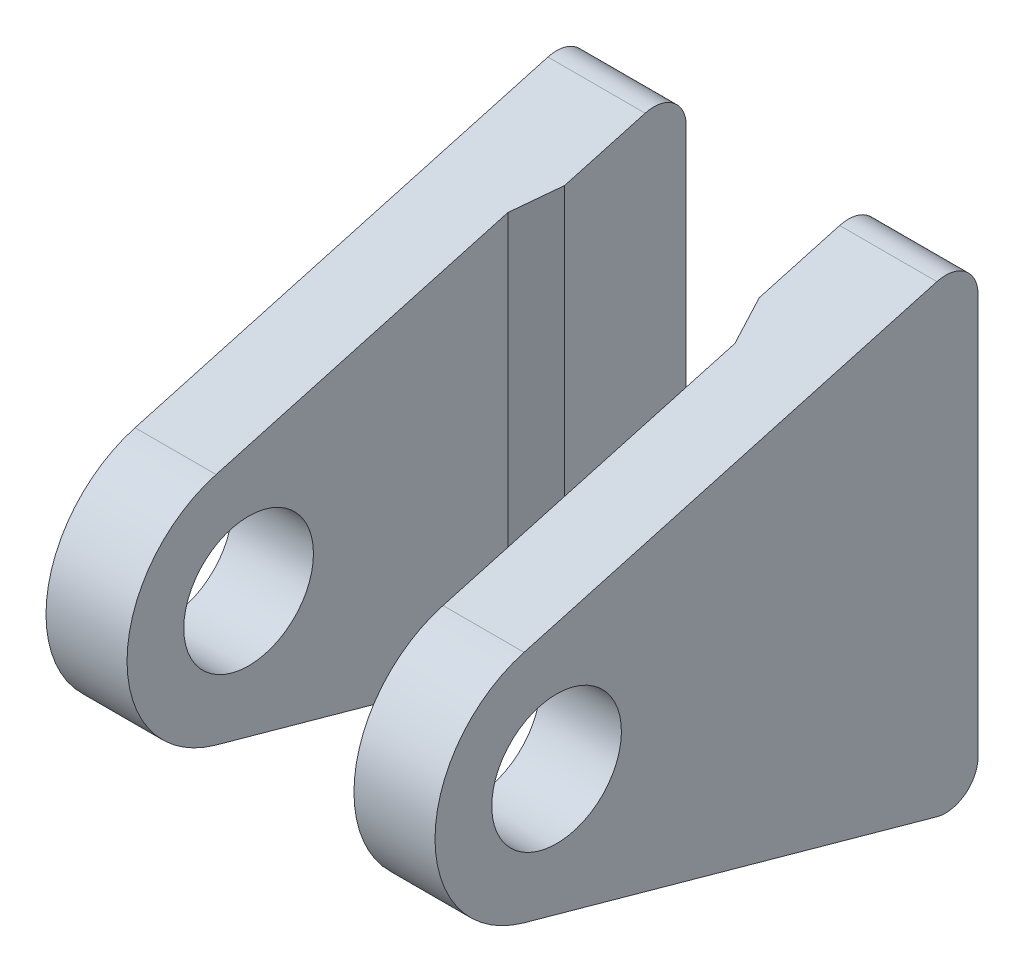
ISO-10303-21;
HEADER;
FILE_DESCRIPTION(('STEP AP214'),'2;1');
FILE_NAME('part.step','',(''),(''),'','','');
FILE_SCHEMA(('AUTOMOTIVE_DESIGN { 1 0 10303 214 1 1 1 1 }'));
ENDSEC;
DATA;
#1=APPLICATION_CONTEXT('core data for automotive mechanical design processes');
#2=APPLICATION_PROTOCOL_DEFINITION('international standard','automotive_design',2000,#1);
#3=PRODUCT_CONTEXT('',#1,'mechanical');
#4=PRODUCT('Part','Part','',(#3));
#5=PRODUCT_RELATED_PRODUCT_CATEGORY('part','',(#4));
#6=PRODUCT_DEFINITION_FORMATION('','',#4);
#7=PRODUCT_DEFINITION_CONTEXT('part definition',#1,'design');
#8=PRODUCT_DEFINITION('design','',#6,#7);
#9=PRODUCT_DEFINITION_SHAPE('','',#8);
#10=(LENGTH_UNIT() NAMED_UNIT(*) SI_UNIT(.MILLI.,.METRE.));
#11=(NAMED_UNIT(*) PLANE_ANGLE_UNIT() SI_UNIT($,.RADIAN.));
#12=(NAMED_UNIT(*) SI_UNIT($,.STERADIAN.) SOLID_ANGLE_UNIT());
#13=UNCERTAINTY_MEASURE_WITH_UNIT(LENGTH_MEASURE(1.E-05),#10,'distance_accuracy_value','');
#14=(GEOMETRIC_REPRESENTATION_CONTEXT(3) GLOBAL_UNCERTAINTY_ASSIGNED_CONTEXT((#13)) GLOBAL_UNIT_ASSIGNED_CONTEXT((#10,
#11,#12)) REPRESENTATION_CONTEXT('',''));
#15=CARTESIAN_POINT('',(0.,0.,0.));
#16=DIRECTION('',(0.,0.,1.));
#17=DIRECTION('',(1.,0.,0.));
#18=AXIS2_PLACEMENT_3D('',#15,#16,#17);
#19=CARTESIAN_POINT('',(-12.,15.,4.));
#20=DIRECTION('',(1.,0.,0.));
#21=DIRECTION('',(0.,1.,0.));
#22=AXIS2_PLACEMENT_3D('',#19,#20,#21);
#23=PLANE('',#22);
#24=CARTESIAN_POINT('',(-12.,0.,30.));
#25=DIRECTION('',(1.,0.,0.));
#26=DIRECTION('',(0.,1.,0.));
#27=AXIS2_PLACEMENT_3D('',#24,#25,#26);
#28=CIRCLE('',#27,4.);
#29=CARTESIAN_POINT('',(-12.,4.,30.));
#30=VERTEX_POINT('',#29);
#31=EDGE_CURVE('E173',#30,#30,#28,.T.);
#32=ORIENTED_EDGE('',*,*,#31,.T.);
#33=EDGE_LOOP('',(#32));
#34=FACE_BOUND('',#33,.T.);
#35=DIRECTION('',(0.,0.267445892208667,-0.963572879828355));
#36=VECTOR('',#35,1.);
#37=CARTESIAN_POINT('',(-12.,15.,4.));
#38=LINE('',#37,#36);
#39=CARTESIAN_POINT('',(-12.,7.22679659871266,32.005844191565));
#40=VERTEX_POINT('',#39);
#41=CARTESIAN_POINT('',(-12.,14.2964243710796,6.53489178441733));
#42=VERTEX_POINT('',#41);
#43=EDGE_CURVE('E155',#40,#42,#38,.T.);
#44=ORIENTED_EDGE('',*,*,#43,.T.);
#45=CARTESIAN_POINT('',(-12.,12.3692786114229,6.));
#46=DIRECTION('',(1.,0.,0.));
#47=DIRECTION('',(0.,1.,0.));
#48=AXIS2_PLACEMENT_3D('',#45,#46,#47);
#49=CIRCLE('',#48,2.);
#50=CARTESIAN_POINT('',(-12.,12.3692786114229,4.));
#51=VERTEX_POINT('',#50);
#52=EDGE_CURVE('E192',#42,#51,#49,.F.);
#53=ORIENTED_EDGE('',*,*,#52,.T.);
#54=DIRECTION('',(0.,1.,0.));
#55=VECTOR('',#54,1.);
#56=CARTESIAN_POINT('',(-12.,15.,4.));
#57=LINE('',#56,#55);
#58=CARTESIAN_POINT('',(-12.,-12.3692786114228,4.));
#59=VERTEX_POINT('',#58);
#60=EDGE_CURVE('E204',#59,#51,#57,.T.);
#61=ORIENTED_EDGE('',*,*,#60,.F.);
#62=CARTESIAN_POINT('',(-12.,-12.3692786114228,6.));
#63=DIRECTION('',(1.,0.,0.));
#64=DIRECTION('',(0.,1.,0.));
#65=AXIS2_PLACEMENT_3D('',#62,#63,#64);
#66=CIRCLE('',#65,2.);
#67=CARTESIAN_POINT('',(-12.,-14.2964243710796,6.53489178441733));
#68=VERTEX_POINT('',#67);
#69=EDGE_CURVE('E190',#59,#68,#66,.F.);
#70=ORIENTED_EDGE('',*,*,#69,.T.);
#71=DIRECTION('',(0.,0.267445892208666,0.963572879828355));
#72=VECTOR('',#71,1.);
#73=CARTESIAN_POINT('',(-12.,-15.,4.));
#74=LINE('',#73,#72);
#75=CARTESIAN_POINT('',(-12.,-7.22679659871267,32.005844191565));
#76=VERTEX_POINT('',#75);
#77=EDGE_CURVE('E172',#68,#76,#74,.T.);
#78=ORIENTED_EDGE('',*,*,#77,.T.);
#79=CARTESIAN_POINT('',(-12.,0.,30.));
#80=DIRECTION('',(-1.,0.,0.));
#81=DIRECTION('',(0.,-1.,0.));
#82=AXIS2_PLACEMENT_3D('',#79,#80,#81);
#83=CIRCLE('',#82,7.5);
#84=EDGE_CURVE('E169',#76,#40,#83,.T.);
#85=ORIENTED_EDGE('',*,*,#84,.T.);
#86=EDGE_LOOP('',(#44,#53,#61,#70,#78,#85));
#87=FACE_BOUND('',#86,.T.);
#88=ADVANCED_FACE('F54',(#34,#87),#23,.F.);
#89=CARTESIAN_POINT('',(-6.,15.,37.5));
#90=DIRECTION('',(-1.,0.,0.));
#91=DIRECTION('',(0.,0.,1.));
#92=AXIS2_PLACEMENT_3D('',#89,#90,#91);
#93=PLANE('',#92);
#94=DIRECTION('',(0.,-1.,0.));
#95=VECTOR('',#94,1.);
#96=CARTESIAN_POINT('',(-6.,15.,4.));
#97=LINE('',#96,#95);
#98=CARTESIAN_POINT('',(-6.,12.3692786114229,4.));
#99=VERTEX_POINT('',#98);
#100=CARTESIAN_POINT('',(-6.,-12.3692786114228,4.));
#101=VERTEX_POINT('',#100);
#102=EDGE_CURVE('E186',#99,#101,#97,.T.);
#103=ORIENTED_EDGE('',*,*,#102,.F.);
#104=CARTESIAN_POINT('',(-6.,12.3692786114229,6.));
#105=DIRECTION('',(-1.,0.,0.));
#106=DIRECTION('',(0.,0.,1.));
#107=AXIS2_PLACEMENT_3D('',#104,#105,#106);
#108=CIRCLE('',#107,2.);
#109=CARTESIAN_POINT('',(-6.,14.2964243710796,6.53489178441733));
#110=VERTEX_POINT('',#109);
#111=EDGE_CURVE('E62',#99,#110,#108,.F.);
#112=ORIENTED_EDGE('',*,*,#111,.T.);
#113=DIRECTION('',(0.,-0.267445892208667,0.963572879828355));
#114=VECTOR('',#113,1.);
#115=CARTESIAN_POINT('',(-6.,15.,4.));
#116=LINE('',#115,#114);
#117=CARTESIAN_POINT('',(-6.,12.9183264353369,11.4999999999999));
#118=VERTEX_POINT('',#117);
#119=EDGE_CURVE('E123',#110,#118,#116,.T.);
#120=ORIENTED_EDGE('',*,*,#119,.T.);
#121=DIRECTION('',(0.,1.,0.));
#122=VECTOR('',#121,1.);
#123=CARTESIAN_POINT('',(-6.,0.,11.5));
#124=LINE('',#123,#122);
#125=CARTESIAN_POINT('',(-6.,-12.9183264353369,11.5));
#126=VERTEX_POINT('',#125);
#127=EDGE_CURVE('E126',#126,#118,#124,.T.);
#128=ORIENTED_EDGE('',*,*,#127,.F.);
#129=DIRECTION('',(0.,-0.267445892208666,-0.963572879828355));
#130=VECTOR('',#129,1.);
#131=CARTESIAN_POINT('',(-6.,-15.,4.));
#132=LINE('',#131,#130);
#133=CARTESIAN_POINT('',(-6.,-14.2964243710796,6.53489178441733));
#134=VERTEX_POINT('',#133);
#135=EDGE_CURVE('E133',#126,#134,#132,.T.);
#136=ORIENTED_EDGE('',*,*,#135,.T.);
#137=CARTESIAN_POINT('',(-6.,-12.3692786114228,6.));
#138=DIRECTION('',(-1.,0.,0.));
#139=DIRECTION('',(0.,0.,1.));
#140=AXIS2_PLACEMENT_3D('',#137,#138,#139);
#141=CIRCLE('',#140,2.);
#142=EDGE_CURVE('E69',#134,#101,#141,.F.);
#143=ORIENTED_EDGE('',*,*,#142,.T.);
#144=EDGE_LOOP('',(#103,#112,#120,#128,#136,#143));
#145=FACE_BOUND('',#144,.T.);
#146=ADVANCED_FACE('F125',(#145),#93,.F.);
#147=CARTESIAN_POINT('',(-7.,15.,4.));
#148=DIRECTION('',(0.,0.963572879828355,0.267445892208667));
#149=DIRECTION('',(0.,-0.267445892208667,0.963572879828355));
#150=AXIS2_PLACEMENT_3D('',#147,#148,#149);
#151=PLANE('',#150);
#152=ORIENTED_EDGE('',*,*,#119,.F.);
#153=DIRECTION('',(-1.,0.,0.));
#154=VECTOR('',#153,1.);
#155=CARTESIAN_POINT('',(-7.,14.2964243710796,6.53489178441733));
#156=LINE('',#155,#154);
#157=EDGE_CURVE('E188',#110,#42,#156,.T.);
#158=ORIENTED_EDGE('',*,*,#157,.T.);
#159=ORIENTED_EDGE('',*,*,#43,.F.);
#160=DIRECTION('',(-1.,0.,0.));
#161=VECTOR('',#160,1.);
#162=CARTESIAN_POINT('',(-7.,7.22679659871266,32.005844191565));
#163=LINE('',#162,#161);
#164=CARTESIAN_POINT('',(-7.,7.22679659871266,32.005844191565));
#165=VERTEX_POINT('',#164);
#166=EDGE_CURVE('E153',#165,#40,#163,.T.);
#167=ORIENTED_EDGE('',*,*,#166,.F.);
#168=DIRECTION('',(0.,0.267445892208667,-0.963572879828355));
#169=VECTOR('',#168,1.);
#170=CARTESIAN_POINT('',(-7.,15.,4.));
#171=LINE('',#170,#169);
#172=CARTESIAN_POINT('',(-7.,12.2244352471159,13.9999999999999));
#173=VERTEX_POINT('',#172);
#174=EDGE_CURVE('E149',#165,#173,#171,.T.);
#175=ORIENTED_EDGE('',*,*,#174,.T.);
#176=DIRECTION('',(0.359640457707022,0.249551344530682,-0.899101144267547));
#177=VECTOR('',#176,1.);
#178=CARTESIAN_POINT('',(-4.34623139652626,14.0658618966439,7.36557849131562));
#179=LINE('',#178,#177);
#180=EDGE_CURVE('E141',#173,#118,#179,.T.);
#181=ORIENTED_EDGE('',*,*,#180,.T.);
#182=EDGE_LOOP('',(#152,#158,#159,#167,#175,#181));
#183=FACE_BOUND('',#182,.T.);
#184=ADVANCED_FACE('F147',(#183),#151,.T.);
#185=CARTESIAN_POINT('',(-7.,0.,30.));
#186=DIRECTION('',(-1.,0.,0.));
#187=DIRECTION('',(0.,-1.,0.));
#188=AXIS2_PLACEMENT_3D('',#185,#186,#187);
#189=CYLINDRICAL_SURFACE('',#188,7.5);
#190=ORIENTED_EDGE('',*,*,#84,.F.);
#191=DIRECTION('',(-1.,0.,0.));
#192=VECTOR('',#191,1.);
#193=CARTESIAN_POINT('',(-7.,-7.22679659871267,32.005844191565));
#194=LINE('',#193,#192);
#195=CARTESIAN_POINT('',(-7.,-7.22679659871267,32.005844191565));
#196=VERTEX_POINT('',#195);
#197=EDGE_CURVE('E163',#196,#76,#194,.T.);
#198=ORIENTED_EDGE('',*,*,#197,.F.);
#199=CARTESIAN_POINT('',(-7.,0.,30.));
#200=DIRECTION('',(-1.,0.,0.));
#201=DIRECTION('',(0.,-1.,0.));
#202=AXIS2_PLACEMENT_3D('',#199,#200,#201);
#203=CIRCLE('',#202,7.5);
#204=EDGE_CURVE('E150',#196,#165,#203,.T.);
#205=ORIENTED_EDGE('',*,*,#204,.T.);
#206=ORIENTED_EDGE('',*,*,#166,.T.);
#207=EDGE_LOOP('',(#190,#198,#205,#206));
#208=FACE_BOUND('',#207,.T.);
#209=ADVANCED_FACE('F213',(#208),#189,.T.);
#210=CARTESIAN_POINT('',(-6.99999999999999,-15.,4.));
#211=DIRECTION('',(0.,-0.963572879828355,0.267445892208666));
#212=DIRECTION('',(0.,-0.267445892208666,-0.963572879828355));
#213=AXIS2_PLACEMENT_3D('',#210,#211,#212);
#214=PLANE('',#213);
#215=ORIENTED_EDGE('',*,*,#77,.F.);
#216=DIRECTION('',(1.,0.,0.));
#217=VECTOR('',#216,1.);
#218=CARTESIAN_POINT('',(-6.99999999999999,-14.2964243710796,6.53489178441733));
#219=LINE('',#218,#217);
#220=EDGE_CURVE('E12',#68,#134,#219,.T.);
#221=ORIENTED_EDGE('',*,*,#220,.T.);
#222=ORIENTED_EDGE('',*,*,#135,.F.);
#223=DIRECTION('',(-0.359640457707022,0.249551344530682,0.899101144267547));
#224=VECTOR('',#223,1.);
#225=CARTESIAN_POINT('',(-4.34623139652625,-14.0658618966439,7.36557849131561));
#226=LINE('',#225,#224);
#227=CARTESIAN_POINT('',(-7.,-12.2244352471159,13.9999999999999));
#228=VERTEX_POINT('',#227);
#229=EDGE_CURVE('E142',#126,#228,#226,.T.);
#230=ORIENTED_EDGE('',*,*,#229,.T.);
#231=DIRECTION('',(0.,0.267445892208666,0.963572879828355));
#232=VECTOR('',#231,1.);
#233=CARTESIAN_POINT('',(-6.99999999999999,-15.,4.));
#234=LINE('',#233,#232);
#235=EDGE_CURVE('E160',#228,#196,#234,.T.);
#236=ORIENTED_EDGE('',*,*,#235,.T.);
#237=ORIENTED_EDGE('',*,*,#197,.T.);
#238=EDGE_LOOP('',(#215,#221,#222,#230,#236,#237));
#239=FACE_BOUND('',#238,.T.);
#240=ADVANCED_FACE('F219',(#239),#214,.T.);
#241=CARTESIAN_POINT('',(-7.,0.,30.));
#242=DIRECTION('',(-1.,0.,0.));
#243=DIRECTION('',(0.,-1.,0.));
#244=AXIS2_PLACEMENT_3D('',#241,#242,#243);
#245=PLANE('',#244);
#246=CARTESIAN_POINT('',(-7.,0.,30.));
#247=DIRECTION('',(-1.,0.,0.));
#248=DIRECTION('',(0.,-1.,0.));
#249=AXIS2_PLACEMENT_3D('',#246,#247,#248);
#250=CIRCLE('',#249,4.);
#251=CARTESIAN_POINT('',(-7.,-4.,30.));
#252=VERTEX_POINT('',#251);
#253=EDGE_CURVE('E162',#252,#252,#250,.T.);
#254=ORIENTED_EDGE('',*,*,#253,.T.);
#255=EDGE_LOOP('',(#254));
#256=FACE_BOUND('',#255,.T.);
#257=ORIENTED_EDGE('',*,*,#235,.F.);
#258=DIRECTION('',(0.,1.,0.));
#259=VECTOR('',#258,1.);
#260=CARTESIAN_POINT('',(-7.,0.,13.9999999999999));
#261=LINE('',#260,#259);
#262=EDGE_CURVE('E144',#228,#173,#261,.T.);
#263=ORIENTED_EDGE('',*,*,#262,.T.);
#264=ORIENTED_EDGE('',*,*,#174,.F.);
#265=ORIENTED_EDGE('',*,*,#204,.F.);
#266=EDGE_LOOP('',(#257,#263,#264,#265));
#267=FACE_BOUND('',#266,.T.);
#268=ADVANCED_FACE('F217',(#256,#267),#245,.F.);
#269=CARTESIAN_POINT('',(-12.,0.,30.));
#270=DIRECTION('',(1.,0.,0.));
#271=DIRECTION('',(0.,1.,0.));
#272=AXIS2_PLACEMENT_3D('',#269,#270,#271);
#273=CYLINDRICAL_SURFACE('',#272,4.);
#274=ORIENTED_EDGE('',*,*,#31,.F.);
#275=EDGE_LOOP('',(#274));
#276=FACE_BOUND('',#275,.T.);
#277=ORIENTED_EDGE('',*,*,#253,.F.);
#278=EDGE_LOOP('',(#277));
#279=FACE_BOUND('',#278,.T.);
#280=ADVANCED_FACE('F261',(#276,#279),#273,.F.);
#281=CARTESIAN_POINT('',(-3.,0.,4.));
#282=DIRECTION('',(-0.928476690885258,0.,-0.371390676354106));
#283=DIRECTION('',(0.,-1.,0.));
#284=AXIS2_PLACEMENT_3D('',#281,#282,#283);
#285=PLANE('',#284);
#286=ORIENTED_EDGE('',*,*,#229,.F.);
#287=ORIENTED_EDGE('',*,*,#127,.T.);
#288=ORIENTED_EDGE('',*,*,#180,.F.);
#289=ORIENTED_EDGE('',*,*,#262,.F.);
#290=EDGE_LOOP('',(#286,#287,#288,#289));
#291=FACE_BOUND('',#290,.T.);
#292=ADVANCED_FACE('F139',(#291),#285,.F.);
#293=CARTESIAN_POINT('',(0.,0.,4.));
#294=DIRECTION('',(0.,0.,-1.));
#295=DIRECTION('',(-1.,0.,0.));
#296=AXIS2_PLACEMENT_3D('',#293,#294,#295);
#297=PLANE('',#296);
#298=ORIENTED_EDGE('',*,*,#60,.T.);
#299=DIRECTION('',(-1.,0.,0.));
#300=VECTOR('',#299,1.);
#301=CARTESIAN_POINT('',(0.,12.3692786114229,4.));
#302=LINE('',#301,#300);
#303=EDGE_CURVE('E196',#51,#99,#302,.F.);
#304=ORIENTED_EDGE('',*,*,#303,.T.);
#305=ORIENTED_EDGE('',*,*,#102,.T.);
#306=DIRECTION('',(1.,0.,0.));
#307=VECTOR('',#306,1.);
#308=CARTESIAN_POINT('',(0.,-12.3692786114228,4.));
#309=LINE('',#308,#307);
#310=EDGE_CURVE('E194',#101,#59,#309,.F.);
#311=ORIENTED_EDGE('',*,*,#310,.T.);
#312=EDGE_LOOP('',(#298,#304,#305,#311));
#313=FACE_BOUND('',#312,.T.);
#314=CARTESIAN_POINT('',(-9.,8.,4.));
#315=DIRECTION('',(0.,0.,-1.));
#316=DIRECTION('',(-1.,0.,0.));
#317=AXIS2_PLACEMENT_3D('',#314,#315,#316);
#318=CIRCLE('',#317,2.09999999999999);
#319=CARTESIAN_POINT('',(-11.1,8.,4.));
#320=VERTEX_POINT('',#319);
#321=EDGE_CURVE('E221',#320,#320,#318,.F.);
#322=ORIENTED_EDGE('',*,*,#321,.T.);
#323=EDGE_LOOP('',(#322));
#324=FACE_BOUND('',#323,.T.);
#325=CARTESIAN_POINT('',(-9.,-8.,4.));
#326=DIRECTION('',(0.,0.,-1.));
#327=DIRECTION('',(-1.,0.,0.));
#328=AXIS2_PLACEMENT_3D('',#325,#326,#327);
#329=CIRCLE('',#328,2.09999999999999);
#330=CARTESIAN_POINT('',(-11.1,-8.,4.));
#331=VERTEX_POINT('',#330);
#332=EDGE_CURVE('E180',#331,#331,#329,.F.);
#333=ORIENTED_EDGE('',*,*,#332,.T.);
#334=EDGE_LOOP('',(#333));
#335=FACE_BOUND('',#334,.T.);
#336=ADVANCED_FACE('F201',(#313,#324,#335),#297,.T.);
#337=CARTESIAN_POINT('',(-9.,8.,10.));
#338=DIRECTION('',(0.,0.,-1.));
#339=DIRECTION('',(-1.,0.,0.));
#340=AXIS2_PLACEMENT_3D('',#337,#338,#339);
#341=CONICAL_SURFACE('',#340,2.1,1.02974425867665);
#342=CARTESIAN_POINT('',(-9.00000000000001,8.,11.2618072999579));
#343=VERTEX_POINT('',#342);
#344=VERTEX_LOOP('',#343);
#345=FACE_BOUND('',#344,.T.);
#346=CARTESIAN_POINT('',(-9.,8.,10.));
#347=DIRECTION('',(0.,0.,-1.));
#348=DIRECTION('',(-1.,0.,0.));
#349=AXIS2_PLACEMENT_3D('',#346,#347,#348);
#350=CIRCLE('',#349,2.1);
#351=CARTESIAN_POINT('',(-11.1,8.,10.));
#352=VERTEX_POINT('',#351);
#353=EDGE_CURVE('E134',#352,#352,#350,.T.);
#354=ORIENTED_EDGE('',*,*,#353,.T.);
#355=EDGE_LOOP('',(#354));
#356=FACE_BOUND('',#355,.T.);
#357=ADVANCED_FACE('F276',(#345,#356),#341,.F.);
#358=CARTESIAN_POINT('',(-9.,8.,0.));
#359=DIRECTION('',(0.,0.,-1.));
#360=DIRECTION('',(-1.,0.,0.));
#361=AXIS2_PLACEMENT_3D('',#358,#359,#360);
#362=CYLINDRICAL_SURFACE('',#361,2.09999999999999);
#363=ORIENTED_EDGE('',*,*,#353,.F.);
#364=EDGE_LOOP('',(#363));
#365=FACE_BOUND('',#364,.T.);
#366=ORIENTED_EDGE('',*,*,#321,.F.);
#367=EDGE_LOOP('',(#366));
#368=FACE_BOUND('',#367,.T.);
#369=ADVANCED_FACE('F238',(#365,#368),#362,.F.);
#370=CARTESIAN_POINT('',(-9.,-8.,10.));
#371=DIRECTION('',(0.,0.,-1.));
#372=DIRECTION('',(-1.,0.,0.));
#373=AXIS2_PLACEMENT_3D('',#370,#371,#372);
#374=CONICAL_SURFACE('',#373,2.1,1.02974425867665);
#375=CARTESIAN_POINT('',(-9.00000000000001,-8.,11.2618072999579));
#376=VERTEX_POINT('',#375);
#377=VERTEX_LOOP('',#376);
#378=FACE_BOUND('',#377,.T.);
#379=CARTESIAN_POINT('',(-9.,-8.,10.));
#380=DIRECTION('',(0.,0.,-1.));
#381=DIRECTION('',(-1.,0.,0.));
#382=AXIS2_PLACEMENT_3D('',#379,#380,#381);
#383=CIRCLE('',#382,2.1);
#384=CARTESIAN_POINT('',(-11.1,-8.,10.));
#385=VERTEX_POINT('',#384);
#386=EDGE_CURVE('E143',#385,#385,#383,.T.);
#387=ORIENTED_EDGE('',*,*,#386,.T.);
#388=EDGE_LOOP('',(#387));
#389=FACE_BOUND('',#388,.T.);
#390=ADVANCED_FACE('F231',(#378,#389),#374,.F.);
#391=CARTESIAN_POINT('',(-9.,-8.,0.));
#392=DIRECTION('',(0.,0.,-1.));
#393=DIRECTION('',(-1.,0.,0.));
#394=AXIS2_PLACEMENT_3D('',#391,#392,#393);
#395=CYLINDRICAL_SURFACE('',#394,2.09999999999999);
#396=ORIENTED_EDGE('',*,*,#386,.F.);
#397=EDGE_LOOP('',(#396));
#398=FACE_BOUND('',#397,.T.);
#399=ORIENTED_EDGE('',*,*,#332,.F.);
#400=EDGE_LOOP('',(#399));
#401=FACE_BOUND('',#400,.T.);
#402=ADVANCED_FACE('F229',(#398,#401),#395,.F.);
#403=CARTESIAN_POINT('',(-7.,12.3692786114229,6.));
#404=DIRECTION('',(-1.,0.,0.));
#405=DIRECTION('',(0.,-1.,0.));
#406=AXIS2_PLACEMENT_3D('',#403,#404,#405);
#407=CYLINDRICAL_SURFACE('',#406,2.);
#408=ORIENTED_EDGE('',*,*,#111,.F.);
#409=ORIENTED_EDGE('',*,*,#303,.F.);
#410=ORIENTED_EDGE('',*,*,#52,.F.);
#411=ORIENTED_EDGE('',*,*,#157,.F.);
#412=EDGE_LOOP('',(#408,#409,#410,#411));
#413=FACE_BOUND('',#412,.T.);
#414=ADVANCED_FACE('F206',(#413),#407,.T.);
#415=CARTESIAN_POINT('',(-6.99999999999999,-12.3692786114228,6.));
#416=DIRECTION('',(1.,0.,0.));
#417=DIRECTION('',(0.,1.,0.));
#418=AXIS2_PLACEMENT_3D('',#415,#416,#417);
#419=CYLINDRICAL_SURFACE('',#418,2.);
#420=ORIENTED_EDGE('',*,*,#69,.F.);
#421=ORIENTED_EDGE('',*,*,#310,.F.);
#422=ORIENTED_EDGE('',*,*,#142,.F.);
#423=ORIENTED_EDGE('',*,*,#220,.F.);
#424=EDGE_LOOP('',(#420,#421,#422,#423));
#425=FACE_BOUND('',#424,.T.);
#426=ADVANCED_FACE('F56',(#425),#419,.T.);
#427=CLOSED_SHELL('',(#88,#146,#184,#209,#240,#268,#280,#292,#336,#357,#369,#390,#402,#414,#426));
#428=MANIFOLD_SOLID_BREP('B2',#427);
#429=CARTESIAN_POINT('',(8.99999999999999,-8.,0.));
#430=DIRECTION('',(0.,0.,-1.));
#431=DIRECTION('',(-1.,0.,0.));
#432=AXIS2_PLACEMENT_3D('',#429,#430,#431);
#433=CYLINDRICAL_SURFACE('',#432,2.09999999999999);
#434=CARTESIAN_POINT('',(8.99999999999999,-8.,10.));
#435=DIRECTION('',(0.,0.,-1.));
#436=DIRECTION('',(-1.,0.,0.));
#437=AXIS2_PLACEMENT_3D('',#434,#435,#436);
#438=CIRCLE('',#437,2.1);
#439=CARTESIAN_POINT('',(6.9,-8.,10.));
#440=VERTEX_POINT('',#439);
#441=EDGE_CURVE('E572',#440,#440,#438,.T.);
#442=ORIENTED_EDGE('',*,*,#441,.F.);
#443=EDGE_LOOP('',(#442));
#444=FACE_BOUND('',#443,.T.);
#445=CARTESIAN_POINT('',(8.99999999999999,-8.,4.));
#446=DIRECTION('',(0.,0.,-1.));
#447=DIRECTION('',(-1.,0.,0.));
#448=AXIS2_PLACEMENT_3D('',#445,#446,#447);
#449=CIRCLE('',#448,2.09999999999999);
#450=CARTESIAN_POINT('',(6.9,-8.,4.));
#451=VERTEX_POINT('',#450);
#452=EDGE_CURVE('E559',#451,#451,#449,.F.);
#453=ORIENTED_EDGE('',*,*,#452,.F.);
#454=EDGE_LOOP('',(#453));
#455=FACE_BOUND('',#454,.T.);
#456=ADVANCED_FACE('F407',(#444,#455),#433,.F.);
#457=CARTESIAN_POINT('',(8.99999999999999,-8.,10.));
#458=DIRECTION('',(0.,0.,-1.));
#459=DIRECTION('',(-1.,0.,0.));
#460=AXIS2_PLACEMENT_3D('',#457,#458,#459);
#461=CONICAL_SURFACE('',#460,2.1,1.02974425867665);
#462=CARTESIAN_POINT('',(8.99999999999999,-8.,11.2618072999579));
#463=VERTEX_POINT('',#462);
#464=VERTEX_LOOP('',#463);
#465=FACE_BOUND('',#464,.T.);
#466=ORIENTED_EDGE('',*,*,#441,.T.);
#467=EDGE_LOOP('',(#466));
#468=FACE_BOUND('',#467,.T.);
#469=ADVANCED_FACE('F620',(#465,#468),#461,.F.);
#470=CARTESIAN_POINT('',(0.,0.,4.));
#471=DIRECTION('',(0.,0.,-1.));
#472=DIRECTION('',(-1.,0.,0.));
#473=AXIS2_PLACEMENT_3D('',#470,#471,#472);
#474=PLANE('',#473);
#475=DIRECTION('',(0.,1.,0.));
#476=VECTOR('',#475,1.);
#477=CARTESIAN_POINT('',(6.,15.,4.));
#478=LINE('',#477,#476);
#479=CARTESIAN_POINT('',(6.,-12.3692786114228,4.));
#480=VERTEX_POINT('',#479);
#481=CARTESIAN_POINT('',(6.,12.3692786114229,4.));
#482=VERTEX_POINT('',#481);
#483=EDGE_CURVE('E501',#480,#482,#478,.T.);
#484=ORIENTED_EDGE('',*,*,#483,.T.);
#485=DIRECTION('',(-1.,0.,0.));
#486=VECTOR('',#485,1.);
#487=CARTESIAN_POINT('',(12.,12.3692786114229,4.));
#488=LINE('',#487,#486);
#489=CARTESIAN_POINT('',(12.,12.3692786114229,4.));
#490=VERTEX_POINT('',#489);
#491=EDGE_CURVE('E529',#482,#490,#488,.F.);
#492=ORIENTED_EDGE('',*,*,#491,.T.);
#493=DIRECTION('',(0.,-1.,0.));
#494=VECTOR('',#493,1.);
#495=CARTESIAN_POINT('',(12.,15.,4.));
#496=LINE('',#495,#494);
#497=CARTESIAN_POINT('',(12.,-12.3692786114228,4.));
#498=VERTEX_POINT('',#497);
#499=EDGE_CURVE('E539',#490,#498,#496,.T.);
#500=ORIENTED_EDGE('',*,*,#499,.T.);
#501=DIRECTION('',(1.,0.,0.));
#502=VECTOR('',#501,1.);
#503=CARTESIAN_POINT('',(6.,-12.3692786114228,4.));
#504=LINE('',#503,#502);
#505=EDGE_CURVE('E526',#498,#480,#504,.F.);
#506=ORIENTED_EDGE('',*,*,#505,.T.);
#507=EDGE_LOOP('',(#484,#492,#500,#506));
#508=FACE_BOUND('',#507,.T.);
#509=CARTESIAN_POINT('',(9.,8.,4.));
#510=DIRECTION('',(0.,0.,-1.));
#511=DIRECTION('',(-1.,0.,0.));
#512=AXIS2_PLACEMENT_3D('',#509,#510,#511);
#513=CIRCLE('',#512,2.09999999999999);
#514=CARTESIAN_POINT('',(6.9,8.,4.));
#515=VERTEX_POINT('',#514);
#516=EDGE_CURVE('E565',#515,#515,#513,.F.);
#517=ORIENTED_EDGE('',*,*,#516,.T.);
#518=EDGE_LOOP('',(#517));
#519=FACE_BOUND('',#518,.T.);
#520=ORIENTED_EDGE('',*,*,#452,.T.);
#521=EDGE_LOOP('',(#520));
#522=FACE_BOUND('',#521,.T.);
#523=ADVANCED_FACE('F553',(#508,#519,#522),#474,.T.);
#524=CARTESIAN_POINT('',(9.,8.,10.));
#525=DIRECTION('',(0.,0.,-1.));
#526=DIRECTION('',(-1.,0.,0.));
#527=AXIS2_PLACEMENT_3D('',#524,#525,#526);
#528=CONICAL_SURFACE('',#527,2.1,1.02974425867665);
#529=CARTESIAN_POINT('',(8.99999999999999,8.,11.2618072999579));
#530=VERTEX_POINT('',#529);
#531=VERTEX_LOOP('',#530);
#532=FACE_BOUND('',#531,.T.);
#533=CARTESIAN_POINT('',(9.,8.,10.));
#534=DIRECTION('',(0.,0.,-1.));
#535=DIRECTION('',(-1.,0.,0.));
#536=AXIS2_PLACEMENT_3D('',#533,#534,#535);
#537=CIRCLE('',#536,2.1);
#538=CARTESIAN_POINT('',(6.9,8.,10.));
#539=VERTEX_POINT('',#538);
#540=EDGE_CURVE('E491',#539,#539,#537,.T.);
#541=ORIENTED_EDGE('',*,*,#540,.T.);
#542=EDGE_LOOP('',(#541));
#543=FACE_BOUND('',#542,.T.);
#544=ADVANCED_FACE('F631',(#532,#543),#528,.F.);
#545=CARTESIAN_POINT('',(9.,8.,0.));
#546=DIRECTION('',(0.,0.,-1.));
#547=DIRECTION('',(-1.,0.,0.));
#548=AXIS2_PLACEMENT_3D('',#545,#546,#547);
#549=CYLINDRICAL_SURFACE('',#548,2.09999999999999);
#550=ORIENTED_EDGE('',*,*,#540,.F.);
#551=EDGE_LOOP('',(#550));
#552=FACE_BOUND('',#551,.T.);
#553=ORIENTED_EDGE('',*,*,#516,.F.);
#554=EDGE_LOOP('',(#553));
#555=FACE_BOUND('',#554,.T.);
#556=ADVANCED_FACE('F615',(#552,#555),#549,.F.);
#557=CARTESIAN_POINT('',(-12.,0.,30.));
#558=DIRECTION('',(1.,0.,0.));
#559=DIRECTION('',(0.,1.,0.));
#560=AXIS2_PLACEMENT_3D('',#557,#558,#559);
#561=CYLINDRICAL_SURFACE('',#560,4.);
#562=CARTESIAN_POINT('',(7.,0.,30.));
#563=DIRECTION('',(-1.,0.,0.));
#564=DIRECTION('',(0.,-1.,0.));
#565=AXIS2_PLACEMENT_3D('',#562,#563,#564);
#566=CIRCLE('',#565,4.);
#567=CARTESIAN_POINT('',(7.00000000000001,-4.,30.));
#568=VERTEX_POINT('',#567);
#569=EDGE_CURVE('E547',#568,#568,#566,.T.);
#570=ORIENTED_EDGE('',*,*,#569,.T.);
#571=EDGE_LOOP('',(#570));
#572=FACE_BOUND('',#571,.T.);
#573=CARTESIAN_POINT('',(12.,0.,30.));
#574=DIRECTION('',(1.,0.,0.));
#575=DIRECTION('',(0.,1.,0.));
#576=AXIS2_PLACEMENT_3D('',#573,#574,#575);
#577=CIRCLE('',#576,4.);
#578=CARTESIAN_POINT('',(12.,4.,30.));
#579=VERTEX_POINT('',#578);
#580=EDGE_CURVE('E576',#579,#579,#577,.T.);
#581=ORIENTED_EDGE('',*,*,#580,.T.);
#582=EDGE_LOOP('',(#581));
#583=FACE_BOUND('',#582,.T.);
#584=ADVANCED_FACE('F607',(#572,#583),#561,.F.);
#585=CARTESIAN_POINT('',(7.,0.,30.));
#586=DIRECTION('',(1.,0.,0.));
#587=DIRECTION('',(0.,1.,0.));
#588=AXIS2_PLACEMENT_3D('',#585,#586,#587);
#589=CYLINDRICAL_SURFACE('',#588,7.5);
#590=CARTESIAN_POINT('',(12.,0.,30.));
#591=DIRECTION('',(-1.,0.,0.));
#592=DIRECTION('',(0.,-1.,0.));
#593=AXIS2_PLACEMENT_3D('',#590,#591,#592);
#594=CIRCLE('',#593,7.5);
#595=CARTESIAN_POINT('',(12.,-7.22679659871266,32.005844191565));
#596=VERTEX_POINT('',#595);
#597=CARTESIAN_POINT('',(12.,7.22679659871266,32.005844191565));
#598=VERTEX_POINT('',#597);
#599=EDGE_CURVE('E584',#596,#598,#594,.T.);
#600=ORIENTED_EDGE('',*,*,#599,.T.);
#601=DIRECTION('',(1.,0.,0.));
#602=VECTOR('',#601,1.);
#603=CARTESIAN_POINT('',(7.,7.22679659871266,32.005844191565));
#604=LINE('',#603,#602);
#605=CARTESIAN_POINT('',(7.,7.22679659871266,32.005844191565));
#606=VERTEX_POINT('',#605);
#607=EDGE_CURVE('E544',#606,#598,#604,.T.);
#608=ORIENTED_EDGE('',*,*,#607,.F.);
#609=CARTESIAN_POINT('',(7.,0.,30.));
#610=DIRECTION('',(-1.,0.,0.));
#611=DIRECTION('',(0.,-1.,0.));
#612=AXIS2_PLACEMENT_3D('',#609,#610,#611);
#613=CIRCLE('',#612,7.5);
#614=CARTESIAN_POINT('',(7.00000000000001,-7.22679659871266,32.005844191565));
#615=VERTEX_POINT('',#614);
#616=EDGE_CURVE('E587',#615,#606,#613,.T.);
#617=ORIENTED_EDGE('',*,*,#616,.F.);
#618=DIRECTION('',(1.,0.,0.));
#619=VECTOR('',#618,1.);
#620=CARTESIAN_POINT('',(7.00000000000001,-7.22679659871266,32.005844191565));
#621=LINE('',#620,#619);
#622=EDGE_CURVE('E595',#615,#596,#621,.T.);
#623=ORIENTED_EDGE('',*,*,#622,.T.);
#624=EDGE_LOOP('',(#600,#608,#617,#623));
#625=FACE_BOUND('',#624,.T.);
#626=ADVANCED_FACE('F605',(#625),#589,.T.);
#627=CARTESIAN_POINT('',(7.,0.,30.));
#628=DIRECTION('',(-1.,0.,0.));
#629=DIRECTION('',(0.,-1.,0.));
#630=AXIS2_PLACEMENT_3D('',#627,#628,#629);
#631=PLANE('',#630);
#632=ORIENTED_EDGE('',*,*,#569,.F.);
#633=EDGE_LOOP('',(#632));
#634=FACE_BOUND('',#633,.T.);
#635=DIRECTION('',(0.,0.267445892208667,-0.963572879828355));
#636=VECTOR('',#635,1.);
#637=CARTESIAN_POINT('',(7.,15.,4.));
#638=LINE('',#637,#636);
#639=CARTESIAN_POINT('',(7.,12.2244352471159,13.9999999999999));
#640=VERTEX_POINT('',#639);
#641=EDGE_CURVE('E580',#606,#640,#638,.T.);
#642=ORIENTED_EDGE('',*,*,#641,.T.);
#643=DIRECTION('',(0.,-1.,0.));
#644=VECTOR('',#643,1.);
#645=CARTESIAN_POINT('',(7.00000000000001,-15.,13.9999999999999));
#646=LINE('',#645,#644);
#647=CARTESIAN_POINT('',(7.00000000000001,-12.2244352471159,13.9999999999999));
#648=VERTEX_POINT('',#647);
#649=EDGE_CURVE('E506',#640,#648,#646,.T.);
#650=ORIENTED_EDGE('',*,*,#649,.T.);
#651=DIRECTION('',(0.,0.267445892208666,0.963572879828355));
#652=VECTOR('',#651,1.);
#653=CARTESIAN_POINT('',(7.00000000000001,-12.8541808422213,11.7311082566131));
#654=LINE('',#653,#652);
#655=EDGE_CURVE('E583',#648,#615,#654,.T.);
#656=ORIENTED_EDGE('',*,*,#655,.T.);
#657=ORIENTED_EDGE('',*,*,#616,.T.);
#658=EDGE_LOOP('',(#642,#650,#656,#657));
#659=FACE_BOUND('',#658,.T.);
#660=ADVANCED_FACE('F601',(#634,#659),#631,.T.);
#661=CARTESIAN_POINT('',(7.,0.,13.9999999999999));
#662=DIRECTION('',(-0.928476690885259,0.,0.371390676354106));
#663=DIRECTION('',(0.,1.,0.));
#664=AXIS2_PLACEMENT_3D('',#661,#662,#663);
#665=PLANE('',#664);
#666=DIRECTION('',(-0.359640457707022,0.249551344530682,-0.899101144267547));
#667=VECTOR('',#666,1.);
#668=CARTESIAN_POINT('',(3.51736503527887,14.6410049609263,5.29341258819715));
#669=LINE('',#668,#667);
#670=CARTESIAN_POINT('',(6.,12.9183264353369,11.4999999999999));
#671=VERTEX_POINT('',#670);
#672=EDGE_CURVE('E485',#671,#640,#669,.F.);
#673=ORIENTED_EDGE('',*,*,#672,.F.);
#674=DIRECTION('',(0.,1.,0.));
#675=VECTOR('',#674,1.);
#676=CARTESIAN_POINT('',(6.,0.,11.4999999999999));
#677=LINE('',#676,#675);
#678=CARTESIAN_POINT('',(6.,-12.9183264353369,11.4999999999999));
#679=VERTEX_POINT('',#678);
#680=EDGE_CURVE('E495',#671,#679,#677,.F.);
#681=ORIENTED_EDGE('',*,*,#680,.T.);
#682=DIRECTION('',(0.359640457707021,0.249551344530682,0.899101144267548));
#683=VECTOR('',#682,1.);
#684=CARTESIAN_POINT('',(6.20982782833139,-12.7727287542142,12.0245695708284));
#685=LINE('',#684,#683);
#686=EDGE_CURVE('E508',#648,#679,#685,.F.);
#687=ORIENTED_EDGE('',*,*,#686,.F.);
#688=ORIENTED_EDGE('',*,*,#649,.F.);
#689=EDGE_LOOP('',(#673,#681,#687,#688));
#690=FACE_BOUND('',#689,.T.);
#691=ADVANCED_FACE('F504',(#690),#665,.T.);
#692=CARTESIAN_POINT('',(6.,15.,37.5));
#693=DIRECTION('',(1.,0.,0.));
#694=DIRECTION('',(0.,0.,-1.));
#695=AXIS2_PLACEMENT_3D('',#692,#693,#694);
#696=PLANE('',#695);
#697=DIRECTION('',(0.,-0.267445892208667,0.963572879828355));
#698=VECTOR('',#697,1.);
#699=CARTESIAN_POINT('',(6.,15.,4.));
#700=LINE('',#699,#698);
#701=CARTESIAN_POINT('',(6.,14.2964243710796,6.53489178441733));
#702=VERTEX_POINT('',#701);
#703=EDGE_CURVE('E479',#702,#671,#700,.T.);
#704=ORIENTED_EDGE('',*,*,#703,.F.);
#705=CARTESIAN_POINT('',(6.,12.3692786114229,6.));
#706=DIRECTION('',(1.,0.,0.));
#707=DIRECTION('',(0.,0.,-1.));
#708=AXIS2_PLACEMENT_3D('',#705,#706,#707);
#709=CIRCLE('',#708,2.);
#710=EDGE_CURVE('E523',#702,#482,#709,.F.);
#711=ORIENTED_EDGE('',*,*,#710,.T.);
#712=ORIENTED_EDGE('',*,*,#483,.F.);
#713=CARTESIAN_POINT('',(6.,-12.3692786114228,6.));
#714=DIRECTION('',(1.,0.,0.));
#715=DIRECTION('',(0.,0.,-1.));
#716=AXIS2_PLACEMENT_3D('',#713,#714,#715);
#717=CIRCLE('',#716,2.);
#718=CARTESIAN_POINT('',(6.,-14.2964243710796,6.53489178441733));
#719=VERTEX_POINT('',#718);
#720=EDGE_CURVE('E521',#480,#719,#717,.F.);
#721=ORIENTED_EDGE('',*,*,#720,.T.);
#722=DIRECTION('',(0.,-0.267445892208666,-0.963572879828355));
#723=VECTOR('',#722,1.);
#724=CARTESIAN_POINT('',(6.,-12.8541808422213,11.7311082566131));
#725=LINE('',#724,#723);
#726=EDGE_CURVE('E492',#679,#719,#725,.T.);
#727=ORIENTED_EDGE('',*,*,#726,.F.);
#728=ORIENTED_EDGE('',*,*,#680,.F.);
#729=EDGE_LOOP('',(#704,#711,#712,#721,#727,#728));
#730=FACE_BOUND('',#729,.T.);
#731=ADVANCED_FACE('F496',(#730),#696,.F.);
#732=CARTESIAN_POINT('',(7.,15.,4.));
#733=DIRECTION('',(0.,-0.963572879828355,-0.267445892208667));
#734=DIRECTION('',(0.,0.267445892208667,-0.963572879828355));
#735=AXIS2_PLACEMENT_3D('',#732,#733,#734);
#736=PLANE('',#735);
#737=DIRECTION('',(0.,0.267445892208667,-0.963572879828355));
#738=VECTOR('',#737,1.);
#739=CARTESIAN_POINT('',(12.,15.,4.));
#740=LINE('',#739,#738);
#741=CARTESIAN_POINT('',(12.,14.2964243710796,6.53489178441733));
#742=VERTEX_POINT('',#741);
#743=EDGE_CURVE('E538',#598,#742,#740,.T.);
#744=ORIENTED_EDGE('',*,*,#743,.T.);
#745=DIRECTION('',(-1.,0.,0.));
#746=VECTOR('',#745,1.);
#747=CARTESIAN_POINT('',(6.,14.2964243710796,6.53489178441733));
#748=LINE('',#747,#746);
#749=EDGE_CURVE('E488',#742,#702,#748,.T.);
#750=ORIENTED_EDGE('',*,*,#749,.T.);
#751=ORIENTED_EDGE('',*,*,#703,.T.);
#752=ORIENTED_EDGE('',*,*,#672,.T.);
#753=ORIENTED_EDGE('',*,*,#641,.F.);
#754=ORIENTED_EDGE('',*,*,#607,.T.);
#755=EDGE_LOOP('',(#744,#750,#751,#752,#753,#754));
#756=FACE_BOUND('',#755,.T.);
#757=ADVANCED_FACE('F482',(#756),#736,.F.);
#758=CARTESIAN_POINT('',(7.00000000000001,-12.8541808422213,11.7311082566131));
#759=DIRECTION('',(0.,0.963572879828355,-0.267445892208666));
#760=DIRECTION('',(0.,0.267445892208666,0.963572879828355));
#761=AXIS2_PLACEMENT_3D('',#758,#759,#760);
#762=PLANE('',#761);
#763=ORIENTED_EDGE('',*,*,#726,.T.);
#764=DIRECTION('',(1.,0.,0.));
#765=VECTOR('',#764,1.);
#766=CARTESIAN_POINT('',(12.,-14.2964243710796,6.53489178441733));
#767=LINE('',#766,#765);
#768=CARTESIAN_POINT('',(12.,-14.2964243710796,6.53489178441733));
#769=VERTEX_POINT('',#768);
#770=EDGE_CURVE('E52',#719,#769,#767,.T.);
#771=ORIENTED_EDGE('',*,*,#770,.T.);
#772=DIRECTION('',(0.,0.267445892208666,0.963572879828355));
#773=VECTOR('',#772,1.);
#774=CARTESIAN_POINT('',(12.,-12.8541808422213,11.7311082566131));
#775=LINE('',#774,#773);
#776=EDGE_CURVE('E546',#769,#596,#775,.T.);
#777=ORIENTED_EDGE('',*,*,#776,.T.);
#778=ORIENTED_EDGE('',*,*,#622,.F.);
#779=ORIENTED_EDGE('',*,*,#655,.F.);
#780=ORIENTED_EDGE('',*,*,#686,.T.);
#781=EDGE_LOOP('',(#763,#771,#777,#778,#779,#780));
#782=FACE_BOUND('',#781,.T.);
#783=ADVANCED_FACE('F556',(#782),#762,.F.);
#784=CARTESIAN_POINT('',(12.,15.,4.));
#785=DIRECTION('',(-1.,0.,0.));
#786=DIRECTION('',(0.,-1.,0.));
#787=AXIS2_PLACEMENT_3D('',#784,#785,#786);
#788=PLANE('',#787);
#789=ORIENTED_EDGE('',*,*,#580,.F.);
#790=EDGE_LOOP('',(#789));
#791=FACE_BOUND('',#790,.T.);
#792=ORIENTED_EDGE('',*,*,#499,.F.);
#793=CARTESIAN_POINT('',(12.,12.3692786114229,6.));
#794=DIRECTION('',(-1.,0.,0.));
#795=DIRECTION('',(0.,-1.,0.));
#796=AXIS2_PLACEMENT_3D('',#793,#794,#795);
#797=CIRCLE('',#796,2.);
#798=EDGE_CURVE('E416',#490,#742,#797,.F.);
#799=ORIENTED_EDGE('',*,*,#798,.T.);
#800=ORIENTED_EDGE('',*,*,#743,.F.);
#801=ORIENTED_EDGE('',*,*,#599,.F.);
#802=ORIENTED_EDGE('',*,*,#776,.F.);
#803=CARTESIAN_POINT('',(12.,-12.3692786114228,6.));
#804=DIRECTION('',(-1.,0.,0.));
#805=DIRECTION('',(0.,-1.,0.));
#806=AXIS2_PLACEMENT_3D('',#803,#804,#805);
#807=CIRCLE('',#806,2.);
#808=EDGE_CURVE('E423',#769,#498,#807,.F.);
#809=ORIENTED_EDGE('',*,*,#808,.T.);
#810=EDGE_LOOP('',(#792,#799,#800,#801,#802,#809));
#811=FACE_BOUND('',#810,.T.);
#812=ADVANCED_FACE('F536',(#791,#811),#788,.F.);
#813=CARTESIAN_POINT('',(7.,12.3692786114229,6.));
#814=DIRECTION('',(1.,0.,0.));
#815=DIRECTION('',(0.,1.,0.));
#816=AXIS2_PLACEMENT_3D('',#813,#814,#815);
#817=CYLINDRICAL_SURFACE('',#816,2.);
#818=ORIENTED_EDGE('',*,*,#798,.F.);
#819=ORIENTED_EDGE('',*,*,#491,.F.);
#820=ORIENTED_EDGE('',*,*,#710,.F.);
#821=ORIENTED_EDGE('',*,*,#749,.F.);
#822=EDGE_LOOP('',(#818,#819,#820,#821));
#823=FACE_BOUND('',#822,.T.);
#824=ADVANCED_FACE('F549',(#823),#817,.T.);
#825=CARTESIAN_POINT('',(7.00000000000001,-12.3692786114228,6.));
#826=DIRECTION('',(-1.,0.,0.));
#827=DIRECTION('',(0.,-1.,0.));
#828=AXIS2_PLACEMENT_3D('',#825,#826,#827);
#829=CYLINDRICAL_SURFACE('',#828,2.);
#830=ORIENTED_EDGE('',*,*,#720,.F.);
#831=ORIENTED_EDGE('',*,*,#505,.F.);
#832=ORIENTED_EDGE('',*,*,#808,.F.);
#833=ORIENTED_EDGE('',*,*,#770,.F.);
#834=EDGE_LOOP('',(#830,#831,#832,#833));
#835=FACE_BOUND('',#834,.T.);
#836=ADVANCED_FACE('F409',(#835),#829,.T.);
#837=CLOSED_SHELL('',(#456,#469,#523,#544,#556,#584,#626,#660,#691,#731,#757,#783,#812,#824,#836));
#838=MANIFOLD_SOLID_BREP('B6',#837);
#839=ADVANCED_BREP_SHAPE_REPRESENTATION('',(#18,#428,#838),#14);
#840=SHAPE_DEFINITION_REPRESENTATION(#9,#839);
ENDSEC;
END-ISO-10303-21;
